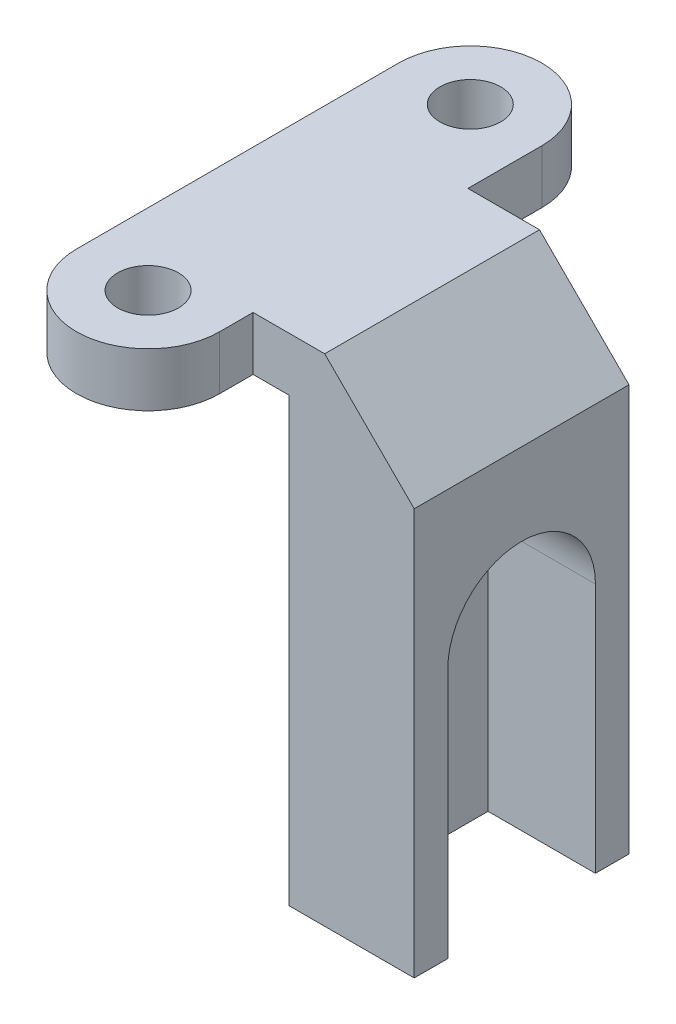
ISO-10303-21;
HEADER;
FILE_DESCRIPTION(('STEP AP214'),'2;1');
FILE_NAME('part.step','',(''),(''),'','','');
FILE_SCHEMA(('AUTOMOTIVE_DESIGN { 1 0 10303 214 1 1 1 1 }'));
ENDSEC;
DATA;
#1=APPLICATION_CONTEXT('core data for automotive mechanical design processes');
#2=APPLICATION_PROTOCOL_DEFINITION('international standard','automotive_design',2000,#1);
#3=PRODUCT_CONTEXT('',#1,'mechanical');
#4=PRODUCT('Part','Part','',(#3));
#5=PRODUCT_RELATED_PRODUCT_CATEGORY('part','',(#4));
#6=PRODUCT_DEFINITION_FORMATION('','',#4);
#7=PRODUCT_DEFINITION_CONTEXT('part definition',#1,'design');
#8=PRODUCT_DEFINITION('design','',#6,#7);
#9=PRODUCT_DEFINITION_SHAPE('','',#8);
#10=(LENGTH_UNIT() NAMED_UNIT(*) SI_UNIT(.MILLI.,.METRE.));
#11=(NAMED_UNIT(*) PLANE_ANGLE_UNIT() SI_UNIT($,.RADIAN.));
#12=(NAMED_UNIT(*) SI_UNIT($,.STERADIAN.) SOLID_ANGLE_UNIT());
#13=UNCERTAINTY_MEASURE_WITH_UNIT(LENGTH_MEASURE(1.E-05),#10,'distance_accuracy_value','');
#14=(GEOMETRIC_REPRESENTATION_CONTEXT(3) GLOBAL_UNCERTAINTY_ASSIGNED_CONTEXT((#13)) GLOBAL_UNIT_ASSIGNED_CONTEXT((#10,
#11,#12)) REPRESENTATION_CONTEXT('',''));
#15=CARTESIAN_POINT('',(0.,0.,0.));
#16=DIRECTION('',(0.,0.,1.));
#17=DIRECTION('',(1.,0.,0.));
#18=AXIS2_PLACEMENT_3D('',#15,#16,#17);
#19=CARTESIAN_POINT('',(0.,0.,0.));
#20=DIRECTION('',(0.,1.,0.));
#21=DIRECTION('',(0.,0.,1.));
#22=AXIS2_PLACEMENT_3D('',#19,#20,#21);
#23=PLANE('',#22);
#24=CARTESIAN_POINT('',(0.,0.,-9.));
#25=DIRECTION('',(0.,1.,0.));
#26=DIRECTION('',(0.,0.,1.));
#27=AXIS2_PLACEMENT_3D('',#24,#25,#26);
#28=CIRCLE('',#27,1.7);
#29=CARTESIAN_POINT('',(0.,0.,-7.3));
#30=VERTEX_POINT('',#29);
#31=EDGE_CURVE('E201',#30,#30,#28,.T.);
#32=ORIENTED_EDGE('',*,*,#31,.T.);
#33=EDGE_LOOP('',(#32));
#34=FACE_BOUND('',#33,.T.);
#35=CARTESIAN_POINT('',(0.,0.,9.));
#36=DIRECTION('',(0.,1.,0.));
#37=DIRECTION('',(0.,0.,1.));
#38=AXIS2_PLACEMENT_3D('',#35,#36,#37);
#39=CIRCLE('',#38,1.7);
#40=CARTESIAN_POINT('',(0.,0.,10.7));
#41=VERTEX_POINT('',#40);
#42=EDGE_CURVE('E197',#41,#41,#39,.T.);
#43=ORIENTED_EDGE('',*,*,#42,.T.);
#44=EDGE_LOOP('',(#43));
#45=FACE_BOUND('',#44,.T.);
#46=DIRECTION('',(0.,0.,-1.));
#47=VECTOR('',#46,1.);
#48=CARTESIAN_POINT('',(6.,0.,7.13244143311318));
#49=LINE('',#48,#47);
#50=CARTESIAN_POINT('',(6.,0.,7.13244143311318));
#51=VERTEX_POINT('',#50);
#52=CARTESIAN_POINT('',(6.,0.,-4.86755856688682));
#53=VERTEX_POINT('',#52);
#54=EDGE_CURVE('E180',#51,#53,#49,.T.);
#55=ORIENTED_EDGE('',*,*,#54,.F.);
#56=DIRECTION('',(1.,0.,0.));
#57=VECTOR('',#56,1.);
#58=CARTESIAN_POINT('',(0.,0.,7.13244143311318));
#59=LINE('',#58,#57);
#60=CARTESIAN_POINT('',(4.,0.,7.13244143311318));
#61=VERTEX_POINT('',#60);
#62=EDGE_CURVE('E226',#61,#51,#59,.T.);
#63=ORIENTED_EDGE('',*,*,#62,.F.);
#64=DIRECTION('',(0.,0.,-1.));
#65=VECTOR('',#64,1.);
#66=CARTESIAN_POINT('',(4.,0.,0.));
#67=LINE('',#66,#65);
#68=CARTESIAN_POINT('',(4.,0.,9.));
#69=VERTEX_POINT('',#68);
#70=EDGE_CURVE('E224',#69,#61,#67,.T.);
#71=ORIENTED_EDGE('',*,*,#70,.F.);
#72=CARTESIAN_POINT('',(0.,0.,9.));
#73=DIRECTION('',(0.,1.,0.));
#74=DIRECTION('',(0.,0.,1.));
#75=AXIS2_PLACEMENT_3D('',#72,#73,#74);
#76=CIRCLE('',#75,4.);
#77=CARTESIAN_POINT('',(-4.,0.,9.));
#78=VERTEX_POINT('',#77);
#79=EDGE_CURVE('E222',#78,#69,#76,.T.);
#80=ORIENTED_EDGE('',*,*,#79,.F.);
#81=DIRECTION('',(0.,0.,1.));
#82=VECTOR('',#81,1.);
#83=CARTESIAN_POINT('',(-3.99999999999999,0.,0.));
#84=LINE('',#83,#82);
#85=CARTESIAN_POINT('',(-4.,0.,-9.));
#86=VERTEX_POINT('',#85);
#87=EDGE_CURVE('E219',#86,#78,#84,.T.);
#88=ORIENTED_EDGE('',*,*,#87,.F.);
#89=CARTESIAN_POINT('',(0.,0.,-9.));
#90=DIRECTION('',(0.,1.,0.));
#91=DIRECTION('',(0.,0.,1.));
#92=AXIS2_PLACEMENT_3D('',#89,#90,#91);
#93=CIRCLE('',#92,4.);
#94=CARTESIAN_POINT('',(4.,0.,-9.));
#95=VERTEX_POINT('',#94);
#96=EDGE_CURVE('E206',#95,#86,#93,.T.);
#97=ORIENTED_EDGE('',*,*,#96,.F.);
#98=DIRECTION('',(0.,0.,-1.));
#99=VECTOR('',#98,1.);
#100=CARTESIAN_POINT('',(4.,0.,0.));
#101=LINE('',#100,#99);
#102=CARTESIAN_POINT('',(4.,0.,-4.86755856688682));
#103=VERTEX_POINT('',#102);
#104=EDGE_CURVE('E231',#103,#95,#101,.T.);
#105=ORIENTED_EDGE('',*,*,#104,.F.);
#106=DIRECTION('',(-1.,0.,0.));
#107=VECTOR('',#106,1.);
#108=CARTESIAN_POINT('',(0.,0.,-4.86755856688681));
#109=LINE('',#108,#107);
#110=EDGE_CURVE('E229',#53,#103,#109,.T.);
#111=ORIENTED_EDGE('',*,*,#110,.F.);
#112=EDGE_LOOP('',(#55,#63,#71,#80,#88,#97,#105,#111));
#113=FACE_BOUND('',#112,.T.);
#114=ADVANCED_FACE('F37',(#34,#45,#113),#23,.F.);
#115=CARTESIAN_POINT('',(-3.99999999999999,3.,0.));
#116=DIRECTION('',(1.,0.,0.));
#117=DIRECTION('',(0.,0.,-1.));
#118=AXIS2_PLACEMENT_3D('',#115,#116,#117);
#119=PLANE('',#118);
#120=ORIENTED_EDGE('',*,*,#87,.T.);
#121=DIRECTION('',(0.,-1.,0.));
#122=VECTOR('',#121,1.);
#123=CARTESIAN_POINT('',(-4.,3.,9.));
#124=LINE('',#123,#122);
#125=CARTESIAN_POINT('',(-4.,3.,9.));
#126=VERTEX_POINT('',#125);
#127=EDGE_CURVE('E252',#126,#78,#124,.T.);
#128=ORIENTED_EDGE('',*,*,#127,.F.);
#129=DIRECTION('',(0.,0.,1.));
#130=VECTOR('',#129,1.);
#131=CARTESIAN_POINT('',(-3.99999999999999,3.,0.));
#132=LINE('',#131,#130);
#133=CARTESIAN_POINT('',(-4.,3.,-9.));
#134=VERTEX_POINT('',#133);
#135=EDGE_CURVE('E202',#134,#126,#132,.T.);
#136=ORIENTED_EDGE('',*,*,#135,.F.);
#137=DIRECTION('',(0.,-1.,0.));
#138=VECTOR('',#137,1.);
#139=CARTESIAN_POINT('',(-4.,3.,-9.));
#140=LINE('',#139,#138);
#141=EDGE_CURVE('E218',#134,#86,#140,.T.);
#142=ORIENTED_EDGE('',*,*,#141,.T.);
#143=EDGE_LOOP('',(#120,#128,#136,#142));
#144=FACE_BOUND('',#143,.T.);
#145=ADVANCED_FACE('F298',(#144),#119,.F.);
#146=CARTESIAN_POINT('',(0.,3.,9.));
#147=DIRECTION('',(0.,-1.,0.));
#148=DIRECTION('',(0.,0.,-1.));
#149=AXIS2_PLACEMENT_3D('',#146,#147,#148);
#150=CYLINDRICAL_SURFACE('',#149,4.);
#151=ORIENTED_EDGE('',*,*,#79,.T.);
#152=DIRECTION('',(0.,-1.,0.));
#153=VECTOR('',#152,1.);
#154=CARTESIAN_POINT('',(4.,3.,9.));
#155=LINE('',#154,#153);
#156=CARTESIAN_POINT('',(4.,3.,9.));
#157=VERTEX_POINT('',#156);
#158=EDGE_CURVE('E249',#157,#69,#155,.T.);
#159=ORIENTED_EDGE('',*,*,#158,.F.);
#160=CARTESIAN_POINT('',(0.,3.,9.));
#161=DIRECTION('',(0.,1.,0.));
#162=DIRECTION('',(0.,0.,1.));
#163=AXIS2_PLACEMENT_3D('',#160,#161,#162);
#164=CIRCLE('',#163,4.);
#165=EDGE_CURVE('E205',#126,#157,#164,.T.);
#166=ORIENTED_EDGE('',*,*,#165,.F.);
#167=ORIENTED_EDGE('',*,*,#127,.T.);
#168=EDGE_LOOP('',(#151,#159,#166,#167));
#169=FACE_BOUND('',#168,.T.);
#170=ADVANCED_FACE('F304',(#169),#150,.T.);
#171=CARTESIAN_POINT('',(4.,3.,0.));
#172=DIRECTION('',(-1.,0.,0.));
#173=DIRECTION('',(0.,0.,1.));
#174=AXIS2_PLACEMENT_3D('',#171,#172,#173);
#175=PLANE('',#174);
#176=ORIENTED_EDGE('',*,*,#70,.T.);
#177=DIRECTION('',(0.,-1.,0.));
#178=VECTOR('',#177,1.);
#179=CARTESIAN_POINT('',(4.,3.,7.13244143311318));
#180=LINE('',#179,#178);
#181=CARTESIAN_POINT('',(4.,3.,7.13244143311318));
#182=VERTEX_POINT('',#181);
#183=EDGE_CURVE('E246',#182,#61,#180,.T.);
#184=ORIENTED_EDGE('',*,*,#183,.F.);
#185=DIRECTION('',(0.,0.,-1.));
#186=VECTOR('',#185,1.);
#187=CARTESIAN_POINT('',(4.,3.,0.));
#188=LINE('',#187,#186);
#189=EDGE_CURVE('E208',#157,#182,#188,.T.);
#190=ORIENTED_EDGE('',*,*,#189,.F.);
#191=ORIENTED_EDGE('',*,*,#158,.T.);
#192=EDGE_LOOP('',(#176,#184,#190,#191));
#193=FACE_BOUND('',#192,.T.);
#194=ADVANCED_FACE('F327',(#193),#175,.F.);
#195=CARTESIAN_POINT('',(0.,3.,7.13244143311318));
#196=DIRECTION('',(0.,0.,-1.));
#197=DIRECTION('',(-1.,0.,0.));
#198=AXIS2_PLACEMENT_3D('',#195,#196,#197);
#199=PLANE('',#198);
#200=DIRECTION('',(0.,-1.,0.));
#201=VECTOR('',#200,1.);
#202=CARTESIAN_POINT('',(13.,3.,7.13244143311318));
#203=LINE('',#202,#201);
#204=CARTESIAN_POINT('',(13.,-2.,7.13244143311318));
#205=VERTEX_POINT('',#204);
#206=CARTESIAN_POINT('',(13.,-24.7,7.13244143311318));
#207=VERTEX_POINT('',#206);
#208=EDGE_CURVE('E244',#205,#207,#203,.T.);
#209=ORIENTED_EDGE('',*,*,#208,.F.);
#210=DIRECTION('',(0.707106781186549,-0.707106781186546,0.));
#211=VECTOR('',#210,1.);
#212=CARTESIAN_POINT('',(13.,-2.,7.13244143311318));
#213=LINE('',#212,#211);
#214=CARTESIAN_POINT('',(7.99999999999999,3.,7.13244143311318));
#215=VERTEX_POINT('',#214);
#216=EDGE_CURVE('E59',#205,#215,#213,.F.);
#217=ORIENTED_EDGE('',*,*,#216,.T.);
#218=DIRECTION('',(1.,0.,0.));
#219=VECTOR('',#218,1.);
#220=CARTESIAN_POINT('',(0.,3.,7.13244143311318));
#221=LINE('',#220,#219);
#222=EDGE_CURVE('E210',#182,#215,#221,.T.);
#223=ORIENTED_EDGE('',*,*,#222,.F.);
#224=ORIENTED_EDGE('',*,*,#183,.T.);
#225=ORIENTED_EDGE('',*,*,#62,.T.);
#226=DIRECTION('',(0.,1.,0.));
#227=VECTOR('',#226,1.);
#228=CARTESIAN_POINT('',(6.,-24.7,7.13244143311318));
#229=LINE('',#228,#227);
#230=CARTESIAN_POINT('',(6.,-24.7,7.13244143311318));
#231=VERTEX_POINT('',#230);
#232=EDGE_CURVE('E191',#231,#51,#229,.T.);
#233=ORIENTED_EDGE('',*,*,#232,.F.);
#234=DIRECTION('',(-1.,0.,0.));
#235=VECTOR('',#234,1.);
#236=CARTESIAN_POINT('',(13.,-24.7,7.13244143311318));
#237=LINE('',#236,#235);
#238=EDGE_CURVE('E176',#207,#231,#237,.T.);
#239=ORIENTED_EDGE('',*,*,#238,.F.);
#240=EDGE_LOOP('',(#209,#217,#223,#224,#225,#233,#239));
#241=FACE_BOUND('',#240,.T.);
#242=ADVANCED_FACE('F271',(#241),#199,.F.);
#243=CARTESIAN_POINT('',(13.,3.,0.));
#244=DIRECTION('',(1.,0.,0.));
#245=DIRECTION('',(0.,0.,-1.));
#246=AXIS2_PLACEMENT_3D('',#243,#244,#245);
#247=PLANE('',#246);
#248=DIRECTION('',(0.,-1.,0.));
#249=VECTOR('',#248,1.);
#250=CARTESIAN_POINT('',(13.,3.,-4.86755856688682));
#251=LINE('',#250,#249);
#252=CARTESIAN_POINT('',(13.,-2.,-4.86755856688682));
#253=VERTEX_POINT('',#252);
#254=CARTESIAN_POINT('',(13.,-24.7,-4.86755856688682));
#255=VERTEX_POINT('',#254);
#256=EDGE_CURVE('E242',#253,#255,#251,.T.);
#257=ORIENTED_EDGE('',*,*,#256,.F.);
#258=DIRECTION('',(0.,0.,1.));
#259=VECTOR('',#258,1.);
#260=CARTESIAN_POINT('',(13.,-2.,0.));
#261=LINE('',#260,#259);
#262=EDGE_CURVE('E255',#253,#205,#261,.T.);
#263=ORIENTED_EDGE('',*,*,#262,.T.);
#264=ORIENTED_EDGE('',*,*,#208,.T.);
#265=DIRECTION('',(0.,0.,1.));
#266=VECTOR('',#265,1.);
#267=CARTESIAN_POINT('',(13.,-24.7,-4.86755856688682));
#268=LINE('',#267,#266);
#269=CARTESIAN_POINT('',(13.,-24.7,5.25744143311318));
#270=VERTEX_POINT('',#269);
#271=EDGE_CURVE('E184',#270,#207,#268,.T.);
#272=ORIENTED_EDGE('',*,*,#271,.F.);
#273=DIRECTION('',(0.,-1.,0.));
#274=VECTOR('',#273,1.);
#275=CARTESIAN_POINT('',(13.,-24.7,5.25744143311318));
#276=LINE('',#275,#274);
#277=CARTESIAN_POINT('',(13.,-10.7,5.25744143311318));
#278=VERTEX_POINT('',#277);
#279=EDGE_CURVE('E276',#278,#270,#276,.T.);
#280=ORIENTED_EDGE('',*,*,#279,.F.);
#281=CARTESIAN_POINT('',(13.,-10.7,1.13244143311318));
#282=DIRECTION('',(1.,0.,0.));
#283=DIRECTION('',(0.,0.,1.));
#284=AXIS2_PLACEMENT_3D('',#281,#282,#283);
#285=CIRCLE('',#284,4.125);
#286=CARTESIAN_POINT('',(13.,-10.7,-2.99255856688682));
#287=VERTEX_POINT('',#286);
#288=EDGE_CURVE('E278',#287,#278,#285,.T.);
#289=ORIENTED_EDGE('',*,*,#288,.F.);
#290=DIRECTION('',(0.,1.,0.));
#291=VECTOR('',#290,1.);
#292=CARTESIAN_POINT('',(13.,-10.7,-2.99255856688682));
#293=LINE('',#292,#291);
#294=CARTESIAN_POINT('',(13.,-24.7,-2.99255856688682));
#295=VERTEX_POINT('',#294);
#296=EDGE_CURVE('E280',#295,#287,#293,.T.);
#297=ORIENTED_EDGE('',*,*,#296,.F.);
#298=EDGE_CURVE('E168',#255,#295,#268,.T.);
#299=ORIENTED_EDGE('',*,*,#298,.F.);
#300=EDGE_LOOP('',(#257,#263,#264,#272,#280,#289,#297,#299));
#301=FACE_BOUND('',#300,.T.);
#302=ADVANCED_FACE('F265',(#301),#247,.T.);
#303=CARTESIAN_POINT('',(0.,3.,-4.86755856688681));
#304=DIRECTION('',(0.,0.,1.));
#305=DIRECTION('',(1.,0.,0.));
#306=AXIS2_PLACEMENT_3D('',#303,#304,#305);
#307=PLANE('',#306);
#308=DIRECTION('',(-1.,0.,0.));
#309=VECTOR('',#308,1.);
#310=CARTESIAN_POINT('',(0.,3.,-4.86755856688681));
#311=LINE('',#310,#309);
#312=CARTESIAN_POINT('',(7.99999999999998,3.,-4.86755856688682));
#313=VERTEX_POINT('',#312);
#314=CARTESIAN_POINT('',(4.,3.,-4.86755856688682));
#315=VERTEX_POINT('',#314);
#316=EDGE_CURVE('E212',#313,#315,#311,.T.);
#317=ORIENTED_EDGE('',*,*,#316,.F.);
#318=DIRECTION('',(-0.707106781186549,0.707106781186546,0.));
#319=VECTOR('',#318,1.);
#320=CARTESIAN_POINT('',(13.,-2.,-4.86755856688682));
#321=LINE('',#320,#319);
#322=EDGE_CURVE('E11',#313,#253,#321,.F.);
#323=ORIENTED_EDGE('',*,*,#322,.T.);
#324=ORIENTED_EDGE('',*,*,#256,.T.);
#325=DIRECTION('',(1.,0.,0.));
#326=VECTOR('',#325,1.);
#327=CARTESIAN_POINT('',(6.,-24.7,-4.86755856688682));
#328=LINE('',#327,#326);
#329=CARTESIAN_POINT('',(6.,-24.7,-4.86755856688682));
#330=VERTEX_POINT('',#329);
#331=EDGE_CURVE('E182',#330,#255,#328,.T.);
#332=ORIENTED_EDGE('',*,*,#331,.F.);
#333=DIRECTION('',(0.,1.,0.));
#334=VECTOR('',#333,1.);
#335=CARTESIAN_POINT('',(6.,-24.7,-4.86755856688682));
#336=LINE('',#335,#334);
#337=EDGE_CURVE('E186',#330,#53,#336,.T.);
#338=ORIENTED_EDGE('',*,*,#337,.T.);
#339=ORIENTED_EDGE('',*,*,#110,.T.);
#340=DIRECTION('',(0.,-1.,0.));
#341=VECTOR('',#340,1.);
#342=CARTESIAN_POINT('',(4.,3.,-4.86755856688682));
#343=LINE('',#342,#341);
#344=EDGE_CURVE('E239',#315,#103,#343,.T.);
#345=ORIENTED_EDGE('',*,*,#344,.F.);
#346=EDGE_LOOP('',(#317,#323,#324,#332,#338,#339,#345));
#347=FACE_BOUND('',#346,.T.);
#348=ADVANCED_FACE('F318',(#347),#307,.F.);
#349=CARTESIAN_POINT('',(4.,3.,0.));
#350=DIRECTION('',(-1.,0.,0.));
#351=DIRECTION('',(0.,0.,1.));
#352=AXIS2_PLACEMENT_3D('',#349,#350,#351);
#353=PLANE('',#352);
#354=ORIENTED_EDGE('',*,*,#104,.T.);
#355=DIRECTION('',(0.,-1.,0.));
#356=VECTOR('',#355,1.);
#357=CARTESIAN_POINT('',(4.,3.,-9.));
#358=LINE('',#357,#356);
#359=CARTESIAN_POINT('',(4.,3.,-9.));
#360=VERTEX_POINT('',#359);
#361=EDGE_CURVE('E236',#360,#95,#358,.T.);
#362=ORIENTED_EDGE('',*,*,#361,.F.);
#363=DIRECTION('',(0.,0.,-1.));
#364=VECTOR('',#363,1.);
#365=CARTESIAN_POINT('',(4.,3.,0.));
#366=LINE('',#365,#364);
#367=EDGE_CURVE('E214',#315,#360,#366,.T.);
#368=ORIENTED_EDGE('',*,*,#367,.F.);
#369=ORIENTED_EDGE('',*,*,#344,.T.);
#370=EDGE_LOOP('',(#354,#362,#368,#369));
#371=FACE_BOUND('',#370,.T.);
#372=ADVANCED_FACE('F314',(#371),#353,.F.);
#373=CARTESIAN_POINT('',(0.,3.,-9.));
#374=DIRECTION('',(0.,-1.,0.));
#375=DIRECTION('',(0.,0.,-1.));
#376=AXIS2_PLACEMENT_3D('',#373,#374,#375);
#377=CYLINDRICAL_SURFACE('',#376,4.);
#378=ORIENTED_EDGE('',*,*,#96,.T.);
#379=ORIENTED_EDGE('',*,*,#141,.F.);
#380=CARTESIAN_POINT('',(0.,3.,-9.));
#381=DIRECTION('',(0.,1.,0.));
#382=DIRECTION('',(0.,0.,1.));
#383=AXIS2_PLACEMENT_3D('',#380,#381,#382);
#384=CIRCLE('',#383,4.);
#385=EDGE_CURVE('E216',#360,#134,#384,.T.);
#386=ORIENTED_EDGE('',*,*,#385,.F.);
#387=ORIENTED_EDGE('',*,*,#361,.T.);
#388=EDGE_LOOP('',(#378,#379,#386,#387));
#389=FACE_BOUND('',#388,.T.);
#390=ADVANCED_FACE('F311',(#389),#377,.T.);
#391=CARTESIAN_POINT('',(0.,3.,0.));
#392=DIRECTION('',(0.,1.,0.));
#393=DIRECTION('',(0.,0.,1.));
#394=AXIS2_PLACEMENT_3D('',#391,#392,#393);
#395=PLANE('',#394);
#396=CARTESIAN_POINT('',(0.,3.,9.));
#397=DIRECTION('',(0.,1.,0.));
#398=DIRECTION('',(0.,0.,1.));
#399=AXIS2_PLACEMENT_3D('',#396,#397,#398);
#400=CIRCLE('',#399,1.7);
#401=CARTESIAN_POINT('',(0.,3.,10.7));
#402=VERTEX_POINT('',#401);
#403=EDGE_CURVE('E194',#402,#402,#400,.T.);
#404=ORIENTED_EDGE('',*,*,#403,.F.);
#405=EDGE_LOOP('',(#404));
#406=FACE_BOUND('',#405,.T.);
#407=CARTESIAN_POINT('',(0.,3.,-9.));
#408=DIRECTION('',(0.,1.,0.));
#409=DIRECTION('',(0.,0.,1.));
#410=AXIS2_PLACEMENT_3D('',#407,#408,#409);
#411=CIRCLE('',#410,1.7);
#412=CARTESIAN_POINT('',(0.,3.,-7.3));
#413=VERTEX_POINT('',#412);
#414=EDGE_CURVE('E198',#413,#413,#411,.T.);
#415=ORIENTED_EDGE('',*,*,#414,.F.);
#416=EDGE_LOOP('',(#415));
#417=FACE_BOUND('',#416,.T.);
#418=ORIENTED_EDGE('',*,*,#222,.T.);
#419=DIRECTION('',(0.,0.,-1.));
#420=VECTOR('',#419,1.);
#421=CARTESIAN_POINT('',(7.99999999999998,3.,0.));
#422=LINE('',#421,#420);
#423=EDGE_CURVE('E45',#215,#313,#422,.T.);
#424=ORIENTED_EDGE('',*,*,#423,.T.);
#425=ORIENTED_EDGE('',*,*,#316,.T.);
#426=ORIENTED_EDGE('',*,*,#367,.T.);
#427=ORIENTED_EDGE('',*,*,#385,.T.);
#428=ORIENTED_EDGE('',*,*,#135,.T.);
#429=ORIENTED_EDGE('',*,*,#165,.T.);
#430=ORIENTED_EDGE('',*,*,#189,.T.);
#431=EDGE_LOOP('',(#418,#424,#425,#426,#427,#428,#429,#430));
#432=FACE_BOUND('',#431,.T.);
#433=ADVANCED_FACE('F309',(#406,#417,#432),#395,.T.);
#434=CARTESIAN_POINT('',(0.,3.,-9.));
#435=DIRECTION('',(0.,1.,0.));
#436=DIRECTION('',(0.,0.,1.));
#437=AXIS2_PLACEMENT_3D('',#434,#435,#436);
#438=CYLINDRICAL_SURFACE('',#437,1.7);
#439=ORIENTED_EDGE('',*,*,#414,.T.);
#440=EDGE_LOOP('',(#439));
#441=FACE_BOUND('',#440,.T.);
#442=ORIENTED_EDGE('',*,*,#31,.F.);
#443=EDGE_LOOP('',(#442));
#444=FACE_BOUND('',#443,.T.);
#445=ADVANCED_FACE('F407',(#441,#444),#438,.F.);
#446=CARTESIAN_POINT('',(0.,3.,9.));
#447=DIRECTION('',(0.,1.,0.));
#448=DIRECTION('',(0.,0.,1.));
#449=AXIS2_PLACEMENT_3D('',#446,#447,#448);
#450=CYLINDRICAL_SURFACE('',#449,1.7);
#451=ORIENTED_EDGE('',*,*,#403,.T.);
#452=EDGE_LOOP('',(#451));
#453=FACE_BOUND('',#452,.T.);
#454=ORIENTED_EDGE('',*,*,#42,.F.);
#455=EDGE_LOOP('',(#454));
#456=FACE_BOUND('',#455,.T.);
#457=ADVANCED_FACE('F387',(#453,#456),#450,.F.);
#458=CARTESIAN_POINT('',(6.,-24.7,7.13244143311318));
#459=DIRECTION('',(1.,0.,0.));
#460=DIRECTION('',(0.,0.,-1.));
#461=AXIS2_PLACEMENT_3D('',#458,#459,#460);
#462=PLANE('',#461);
#463=ORIENTED_EDGE('',*,*,#54,.T.);
#464=ORIENTED_EDGE('',*,*,#337,.F.);
#465=DIRECTION('',(0.,0.,-1.));
#466=VECTOR('',#465,1.);
#467=CARTESIAN_POINT('',(6.,-24.7,7.13244143311318));
#468=LINE('',#467,#466);
#469=EDGE_CURVE('E179',#231,#330,#468,.T.);
#470=ORIENTED_EDGE('',*,*,#469,.F.);
#471=ORIENTED_EDGE('',*,*,#232,.T.);
#472=EDGE_LOOP('',(#463,#464,#470,#471));
#473=FACE_BOUND('',#472,.T.);
#474=ADVANCED_FACE('F344',(#473),#462,.F.);
#475=CARTESIAN_POINT('',(0.,-24.7,0.));
#476=DIRECTION('',(0.,-1.,0.));
#477=DIRECTION('',(0.,0.,-1.));
#478=AXIS2_PLACEMENT_3D('',#475,#476,#477);
#479=PLANE('',#478);
#480=DIRECTION('',(1.,0.,0.));
#481=VECTOR('',#480,1.);
#482=CARTESIAN_POINT('',(7.,-24.7,5.25744143311318));
#483=LINE('',#482,#481);
#484=CARTESIAN_POINT('',(7.,-24.7,5.25744143311318));
#485=VERTEX_POINT('',#484);
#486=EDGE_CURVE('E169',#485,#270,#483,.T.);
#487=ORIENTED_EDGE('',*,*,#486,.T.);
#488=ORIENTED_EDGE('',*,*,#271,.T.);
#489=ORIENTED_EDGE('',*,*,#238,.T.);
#490=ORIENTED_EDGE('',*,*,#469,.T.);
#491=ORIENTED_EDGE('',*,*,#331,.T.);
#492=ORIENTED_EDGE('',*,*,#298,.T.);
#493=DIRECTION('',(1.,0.,0.));
#494=VECTOR('',#493,1.);
#495=CARTESIAN_POINT('',(7.,-24.7,-2.99255856688682));
#496=LINE('',#495,#494);
#497=CARTESIAN_POINT('',(7.,-24.7,-2.99255856688682));
#498=VERTEX_POINT('',#497);
#499=EDGE_CURVE('E147',#498,#295,#496,.T.);
#500=ORIENTED_EDGE('',*,*,#499,.F.);
#501=DIRECTION('',(0.,0.,-1.));
#502=VECTOR('',#501,1.);
#503=CARTESIAN_POINT('',(7.,-24.7,-2.99255856688682));
#504=LINE('',#503,#502);
#505=EDGE_CURVE('E154',#485,#498,#504,.T.);
#506=ORIENTED_EDGE('',*,*,#505,.F.);
#507=EDGE_LOOP('',(#487,#488,#489,#490,#491,#492,#500,#506));
#508=FACE_BOUND('',#507,.T.);
#509=ADVANCED_FACE('F165',(#508),#479,.T.);
#510=CARTESIAN_POINT('',(7.,-24.7,5.25744143311318));
#511=DIRECTION('',(0.,0.,1.));
#512=DIRECTION('',(1.,0.,0.));
#513=AXIS2_PLACEMENT_3D('',#510,#511,#512);
#514=PLANE('',#513);
#515=ORIENTED_EDGE('',*,*,#279,.T.);
#516=ORIENTED_EDGE('',*,*,#486,.F.);
#517=DIRECTION('',(0.,-1.,0.));
#518=VECTOR('',#517,1.);
#519=CARTESIAN_POINT('',(7.,-24.7,5.25744143311318));
#520=LINE('',#519,#518);
#521=CARTESIAN_POINT('',(7.,-10.7,5.25744143311318));
#522=VERTEX_POINT('',#521);
#523=EDGE_CURVE('E159',#522,#485,#520,.T.);
#524=ORIENTED_EDGE('',*,*,#523,.F.);
#525=DIRECTION('',(1.,0.,0.));
#526=VECTOR('',#525,1.);
#527=CARTESIAN_POINT('',(7.,-10.7,5.25744143311318));
#528=LINE('',#527,#526);
#529=EDGE_CURVE('E171',#522,#278,#528,.T.);
#530=ORIENTED_EDGE('',*,*,#529,.T.);
#531=EDGE_LOOP('',(#515,#516,#524,#530));
#532=FACE_BOUND('',#531,.T.);
#533=ADVANCED_FACE('F285',(#532),#514,.F.);
#534=CARTESIAN_POINT('',(7.,-10.7,1.13244143311318));
#535=DIRECTION('',(1.,0.,0.));
#536=DIRECTION('',(0.,0.,-1.));
#537=AXIS2_PLACEMENT_3D('',#534,#535,#536);
#538=CYLINDRICAL_SURFACE('',#537,4.125);
#539=ORIENTED_EDGE('',*,*,#288,.T.);
#540=ORIENTED_EDGE('',*,*,#529,.F.);
#541=CARTESIAN_POINT('',(7.,-10.7,1.13244143311318));
#542=DIRECTION('',(1.,0.,0.));
#543=DIRECTION('',(0.,0.,1.));
#544=AXIS2_PLACEMENT_3D('',#541,#542,#543);
#545=CIRCLE('',#544,4.125);
#546=CARTESIAN_POINT('',(7.,-10.7,-2.99255856688682));
#547=VERTEX_POINT('',#546);
#548=EDGE_CURVE('E153',#547,#522,#545,.T.);
#549=ORIENTED_EDGE('',*,*,#548,.F.);
#550=DIRECTION('',(1.,0.,0.));
#551=VECTOR('',#550,1.);
#552=CARTESIAN_POINT('',(7.,-10.7,-2.99255856688682));
#553=LINE('',#552,#551);
#554=EDGE_CURVE('E149',#547,#287,#553,.T.);
#555=ORIENTED_EDGE('',*,*,#554,.T.);
#556=EDGE_LOOP('',(#539,#540,#549,#555));
#557=FACE_BOUND('',#556,.T.);
#558=ADVANCED_FACE('F287',(#557),#538,.F.);
#559=CARTESIAN_POINT('',(7.,-10.7,-2.99255856688682));
#560=DIRECTION('',(0.,0.,-1.));
#561=DIRECTION('',(-1.,0.,0.));
#562=AXIS2_PLACEMENT_3D('',#559,#560,#561);
#563=PLANE('',#562);
#564=ORIENTED_EDGE('',*,*,#296,.T.);
#565=ORIENTED_EDGE('',*,*,#554,.F.);
#566=DIRECTION('',(0.,1.,0.));
#567=VECTOR('',#566,1.);
#568=CARTESIAN_POINT('',(7.,-10.7,-2.99255856688682));
#569=LINE('',#568,#567);
#570=EDGE_CURVE('E142',#498,#547,#569,.T.);
#571=ORIENTED_EDGE('',*,*,#570,.F.);
#572=ORIENTED_EDGE('',*,*,#499,.T.);
#573=EDGE_LOOP('',(#564,#565,#571,#572));
#574=FACE_BOUND('',#573,.T.);
#575=ADVANCED_FACE('F145',(#574),#563,.F.);
#576=CARTESIAN_POINT('',(7.,-10.7,1.13244143311318));
#577=DIRECTION('',(-1.,0.,0.));
#578=DIRECTION('',(0.,0.,1.));
#579=AXIS2_PLACEMENT_3D('',#576,#577,#578);
#580=PLANE('',#579);
#581=ORIENTED_EDGE('',*,*,#523,.T.);
#582=ORIENTED_EDGE('',*,*,#505,.T.);
#583=ORIENTED_EDGE('',*,*,#570,.T.);
#584=ORIENTED_EDGE('',*,*,#548,.T.);
#585=EDGE_LOOP('',(#581,#582,#583,#584));
#586=FACE_BOUND('',#585,.T.);
#587=ADVANCED_FACE('F157',(#586),#580,.F.);
#588=CARTESIAN_POINT('',(13.,-2.,0.));
#589=DIRECTION('',(-0.707106781186546,-0.707106781186549,0.));
#590=DIRECTION('',(0.,0.,1.));
#591=AXIS2_PLACEMENT_3D('',#588,#589,#590);
#592=PLANE('',#591);
#593=ORIENTED_EDGE('',*,*,#322,.F.);
#594=ORIENTED_EDGE('',*,*,#423,.F.);
#595=ORIENTED_EDGE('',*,*,#216,.F.);
#596=ORIENTED_EDGE('',*,*,#262,.F.);
#597=EDGE_LOOP('',(#593,#594,#595,#596));
#598=FACE_BOUND('',#597,.T.);
#599=ADVANCED_FACE('F39',(#598),#592,.F.);
#600=CLOSED_SHELL('',(#114,#145,#170,#194,#242,#302,#348,#372,#390,#433,#445,#457,#474,#509,
#533,#558,#575,#587,#599));
#601=MANIFOLD_SOLID_BREP('B2',#600);
#602=ADVANCED_BREP_SHAPE_REPRESENTATION('',(#18,#601),#14);
#603=SHAPE_DEFINITION_REPRESENTATION(#9,#602);
ENDSEC;
END-ISO-10303-21;
